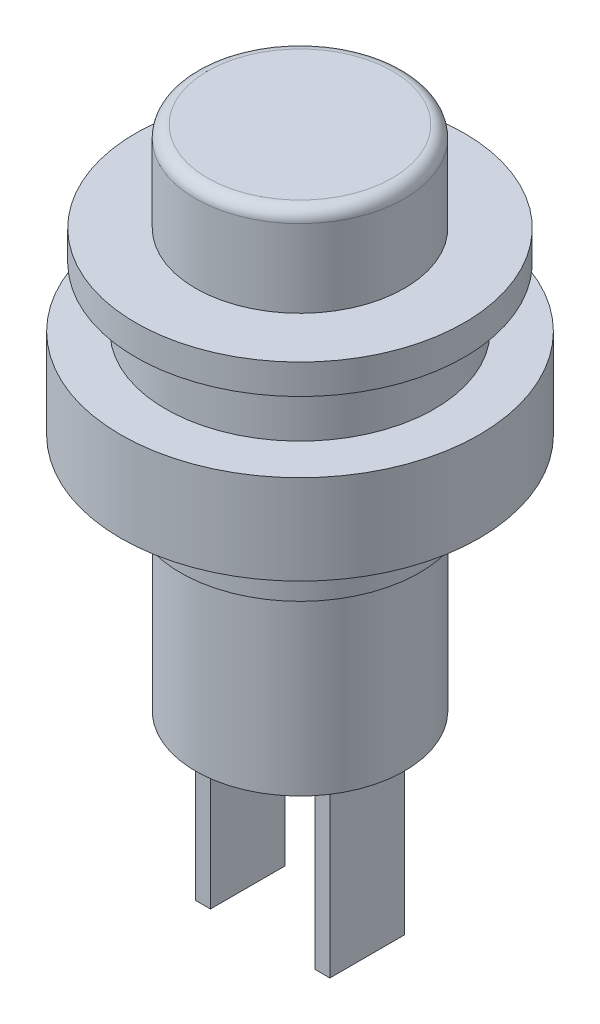
ISO-10303-21;
HEADER;
FILE_DESCRIPTION(('STEP AP214'),'2;1');
FILE_NAME('part.step','',(''),(''),'','','');
FILE_SCHEMA(('AUTOMOTIVE_DESIGN { 1 0 10303 214 1 1 1 1 }'));
ENDSEC;
DATA;
#1=APPLICATION_CONTEXT('core data for automotive mechanical design processes');
#2=APPLICATION_PROTOCOL_DEFINITION('international standard','automotive_design',2000,#1);
#3=PRODUCT_CONTEXT('',#1,'mechanical');
#4=PRODUCT('Part','Part','',(#3));
#5=PRODUCT_RELATED_PRODUCT_CATEGORY('part','',(#4));
#6=PRODUCT_DEFINITION_FORMATION('','',#4);
#7=PRODUCT_DEFINITION_CONTEXT('part definition',#1,'design');
#8=PRODUCT_DEFINITION('design','',#6,#7);
#9=PRODUCT_DEFINITION_SHAPE('','',#8);
#10=(LENGTH_UNIT() NAMED_UNIT(*) SI_UNIT(.MILLI.,.METRE.));
#11=(NAMED_UNIT(*) PLANE_ANGLE_UNIT() SI_UNIT($,.RADIAN.));
#12=(NAMED_UNIT(*) SI_UNIT($,.STERADIAN.) SOLID_ANGLE_UNIT());
#13=UNCERTAINTY_MEASURE_WITH_UNIT(LENGTH_MEASURE(1.E-05),#10,'distance_accuracy_value','');
#14=(GEOMETRIC_REPRESENTATION_CONTEXT(3) GLOBAL_UNCERTAINTY_ASSIGNED_CONTEXT((#13)) GLOBAL_UNIT_ASSIGNED_CONTEXT((#10,
#11,#12)) REPRESENTATION_CONTEXT('',''));
#15=CARTESIAN_POINT('',(0.,0.,0.));
#16=DIRECTION('',(0.,0.,1.));
#17=DIRECTION('',(1.,0.,0.));
#18=AXIS2_PLACEMENT_3D('',#15,#16,#17);
#19=CARTESIAN_POINT('',(0.,3.,0.));
#20=DIRECTION('',(0.,-1.,0.));
#21=DIRECTION('',(0.,0.,-1.));
#22=AXIS2_PLACEMENT_3D('',#19,#20,#21);
#23=CYLINDRICAL_SURFACE('',#22,3.5);
#24=CARTESIAN_POINT('',(0.,2.6,0.));
#25=DIRECTION('',(0.,1.,0.));
#26=DIRECTION('',(0.,0.,1.));
#27=AXIS2_PLACEMENT_3D('',#24,#25,#26);
#28=CIRCLE('',#27,3.5);
#29=CARTESIAN_POINT('',(0.,2.6,3.5));
#30=VERTEX_POINT('',#29);
#31=EDGE_CURVE('E39',#30,#30,#28,.F.);
#32=ORIENTED_EDGE('',*,*,#31,.T.);
#33=EDGE_LOOP('',(#32));
#34=FACE_BOUND('',#33,.T.);
#35=CARTESIAN_POINT('',(0.,0.,0.));
#36=DIRECTION('',(0.,1.,0.));
#37=DIRECTION('',(0.,0.,1.));
#38=AXIS2_PLACEMENT_3D('',#35,#36,#37);
#39=CIRCLE('',#38,3.5);
#40=CARTESIAN_POINT('',(0.,0.,3.5));
#41=VERTEX_POINT('',#40);
#42=EDGE_CURVE('E191',#41,#41,#39,.T.);
#43=ORIENTED_EDGE('',*,*,#42,.T.);
#44=EDGE_LOOP('',(#43));
#45=FACE_BOUND('',#44,.T.);
#46=ADVANCED_FACE('F35',(#34,#45),#23,.T.);
#47=CARTESIAN_POINT('',(0.,3.,0.));
#48=DIRECTION('',(0.,1.,0.));
#49=DIRECTION('',(0.,0.,1.));
#50=AXIS2_PLACEMENT_3D('',#47,#48,#49);
#51=PLANE('',#50);
#52=CARTESIAN_POINT('',(0.,3.,0.));
#53=DIRECTION('',(0.,1.,0.));
#54=DIRECTION('',(0.,0.,1.));
#55=AXIS2_PLACEMENT_3D('',#52,#53,#54);
#56=CIRCLE('',#55,3.1);
#57=CARTESIAN_POINT('',(0.,3.,3.1));
#58=VERTEX_POINT('',#57);
#59=EDGE_CURVE('E195',#58,#58,#56,.T.);
#60=ORIENTED_EDGE('',*,*,#59,.T.);
#61=EDGE_LOOP('',(#60));
#62=FACE_BOUND('',#61,.T.);
#63=ADVANCED_FACE('F207',(#62),#51,.T.);
#64=CARTESIAN_POINT('',(0.,2.6,0.));
#65=DIRECTION('',(0.,1.,0.));
#66=DIRECTION('',(0.,0.,1.));
#67=AXIS2_PLACEMENT_3D('',#64,#65,#66);
#68=TOROIDAL_SURFACE('',#67,3.1,0.4);
#69=ORIENTED_EDGE('',*,*,#31,.F.);
#70=EDGE_LOOP('',(#69));
#71=FACE_BOUND('',#70,.T.);
#72=ORIENTED_EDGE('',*,*,#59,.F.);
#73=EDGE_LOOP('',(#72));
#74=FACE_BOUND('',#73,.T.);
#75=ADVANCED_FACE('F37',(#71,#74),#68,.T.);
#76=CARTESIAN_POINT('',(0.,-1.,0.));
#77=DIRECTION('',(0.,1.,0.));
#78=DIRECTION('',(0.,0.,1.));
#79=AXIS2_PLACEMENT_3D('',#76,#77,#78);
#80=CYLINDRICAL_SURFACE('',#79,5.5);
#81=CARTESIAN_POINT('',(0.,-1.,0.));
#82=DIRECTION('',(0.,-1.,0.));
#83=DIRECTION('',(0.,0.,-1.));
#84=AXIS2_PLACEMENT_3D('',#81,#82,#83);
#85=CIRCLE('',#84,5.5);
#86=CARTESIAN_POINT('',(0.,-1.,-5.5));
#87=VERTEX_POINT('',#86);
#88=EDGE_CURVE('E188',#87,#87,#85,.T.);
#89=ORIENTED_EDGE('',*,*,#88,.F.);
#90=EDGE_LOOP('',(#89));
#91=FACE_BOUND('',#90,.T.);
#92=CARTESIAN_POINT('',(0.,0.,0.));
#93=DIRECTION('',(0.,-1.,0.));
#94=DIRECTION('',(0.,0.,-1.));
#95=AXIS2_PLACEMENT_3D('',#92,#93,#94);
#96=CIRCLE('',#95,5.5);
#97=CARTESIAN_POINT('',(0.,0.,-5.5));
#98=VERTEX_POINT('',#97);
#99=EDGE_CURVE('E185',#98,#98,#96,.T.);
#100=ORIENTED_EDGE('',*,*,#99,.T.);
#101=EDGE_LOOP('',(#100));
#102=FACE_BOUND('',#101,.T.);
#103=ADVANCED_FACE('F206',(#91,#102),#80,.T.);
#104=CARTESIAN_POINT('',(0.,-1.,0.));
#105=DIRECTION('',(0.,-1.,0.));
#106=DIRECTION('',(0.,0.,-1.));
#107=AXIS2_PLACEMENT_3D('',#104,#105,#106);
#108=PLANE('',#107);
#109=CARTESIAN_POINT('',(0.,-1.,0.));
#110=DIRECTION('',(0.,-1.,0.));
#111=DIRECTION('',(0.,0.,-1.));
#112=AXIS2_PLACEMENT_3D('',#109,#110,#111);
#113=CIRCLE('',#112,4.5);
#114=CARTESIAN_POINT('',(0.,-1.,-4.5));
#115=VERTEX_POINT('',#114);
#116=EDGE_CURVE('E176',#115,#115,#113,.T.);
#117=ORIENTED_EDGE('',*,*,#116,.F.);
#118=EDGE_LOOP('',(#117));
#119=FACE_BOUND('',#118,.T.);
#120=ORIENTED_EDGE('',*,*,#88,.T.);
#121=EDGE_LOOP('',(#120));
#122=FACE_BOUND('',#121,.T.);
#123=ADVANCED_FACE('F212',(#119,#122),#108,.T.);
#124=CARTESIAN_POINT('',(0.,0.,0.));
#125=DIRECTION('',(0.,-1.,0.));
#126=DIRECTION('',(0.,0.,-1.));
#127=AXIS2_PLACEMENT_3D('',#124,#125,#126);
#128=PLANE('',#127);
#129=ORIENTED_EDGE('',*,*,#42,.F.);
#130=EDGE_LOOP('',(#129));
#131=FACE_BOUND('',#130,.T.);
#132=ORIENTED_EDGE('',*,*,#99,.F.);
#133=EDGE_LOOP('',(#132));
#134=FACE_BOUND('',#133,.T.);
#135=ADVANCED_FACE('F220',(#131,#134),#128,.F.);
#136=CARTESIAN_POINT('',(0.,-3.,0.));
#137=DIRECTION('',(0.,1.,0.));
#138=DIRECTION('',(0.,0.,1.));
#139=AXIS2_PLACEMENT_3D('',#136,#137,#138);
#140=CYLINDRICAL_SURFACE('',#139,4.5);
#141=CARTESIAN_POINT('',(0.,-3.,0.));
#142=DIRECTION('',(0.,-1.,0.));
#143=DIRECTION('',(0.,0.,-1.));
#144=AXIS2_PLACEMENT_3D('',#141,#142,#143);
#145=CIRCLE('',#144,4.5);
#146=CARTESIAN_POINT('',(0.,-3.,-4.5));
#147=VERTEX_POINT('',#146);
#148=EDGE_CURVE('E180',#147,#147,#145,.T.);
#149=ORIENTED_EDGE('',*,*,#148,.F.);
#150=EDGE_LOOP('',(#149));
#151=FACE_BOUND('',#150,.T.);
#152=ORIENTED_EDGE('',*,*,#116,.T.);
#153=EDGE_LOOP('',(#152));
#154=FACE_BOUND('',#153,.T.);
#155=ADVANCED_FACE('F223',(#151,#154),#140,.T.);
#156=CARTESIAN_POINT('',(0.,-6.,0.));
#157=DIRECTION('',(0.,1.,0.));
#158=DIRECTION('',(0.,0.,1.));
#159=AXIS2_PLACEMENT_3D('',#156,#157,#158);
#160=CYLINDRICAL_SURFACE('',#159,6.);
#161=CARTESIAN_POINT('',(0.,-6.,0.));
#162=DIRECTION('',(0.,-1.,0.));
#163=DIRECTION('',(0.,0.,-1.));
#164=AXIS2_PLACEMENT_3D('',#161,#162,#163);
#165=CIRCLE('',#164,6.);
#166=CARTESIAN_POINT('',(0.,-6.,-6.));
#167=VERTEX_POINT('',#166);
#168=EDGE_CURVE('E177',#167,#167,#165,.T.);
#169=ORIENTED_EDGE('',*,*,#168,.F.);
#170=EDGE_LOOP('',(#169));
#171=FACE_BOUND('',#170,.T.);
#172=CARTESIAN_POINT('',(0.,-3.,0.));
#173=DIRECTION('',(0.,-1.,0.));
#174=DIRECTION('',(0.,0.,-1.));
#175=AXIS2_PLACEMENT_3D('',#172,#173,#174);
#176=CIRCLE('',#175,6.);
#177=CARTESIAN_POINT('',(0.,-3.,-6.));
#178=VERTEX_POINT('',#177);
#179=EDGE_CURVE('E173',#178,#178,#176,.T.);
#180=ORIENTED_EDGE('',*,*,#179,.T.);
#181=EDGE_LOOP('',(#180));
#182=FACE_BOUND('',#181,.T.);
#183=ADVANCED_FACE('F230',(#171,#182),#160,.T.);
#184=CARTESIAN_POINT('',(0.,-6.,0.));
#185=DIRECTION('',(0.,-1.,0.));
#186=DIRECTION('',(0.,0.,-1.));
#187=AXIS2_PLACEMENT_3D('',#184,#185,#186);
#188=PLANE('',#187);
#189=CARTESIAN_POINT('',(0.,-6.,0.));
#190=DIRECTION('',(0.,-1.,0.));
#191=DIRECTION('',(0.,0.,-1.));
#192=AXIS2_PLACEMENT_3D('',#189,#190,#191);
#193=CIRCLE('',#192,4.);
#194=CARTESIAN_POINT('',(0.,-6.,-4.));
#195=VERTEX_POINT('',#194);
#196=EDGE_CURVE('E44',#195,#195,#193,.T.);
#197=ORIENTED_EDGE('',*,*,#196,.F.);
#198=EDGE_LOOP('',(#197));
#199=FACE_BOUND('',#198,.T.);
#200=ORIENTED_EDGE('',*,*,#168,.T.);
#201=EDGE_LOOP('',(#200));
#202=FACE_BOUND('',#201,.T.);
#203=ADVANCED_FACE('F234',(#199,#202),#188,.T.);
#204=CARTESIAN_POINT('',(0.,-3.,0.));
#205=DIRECTION('',(0.,-1.,0.));
#206=DIRECTION('',(0.,0.,-1.));
#207=AXIS2_PLACEMENT_3D('',#204,#205,#206);
#208=PLANE('',#207);
#209=ORIENTED_EDGE('',*,*,#148,.T.);
#210=EDGE_LOOP('',(#209));
#211=FACE_BOUND('',#210,.T.);
#212=ORIENTED_EDGE('',*,*,#179,.F.);
#213=EDGE_LOOP('',(#212));
#214=FACE_BOUND('',#213,.T.);
#215=ADVANCED_FACE('F236',(#211,#214),#208,.F.);
#216=CARTESIAN_POINT('',(0.,-8.,0.));
#217=DIRECTION('',(0.,1.,0.));
#218=DIRECTION('',(0.,0.,1.));
#219=AXIS2_PLACEMENT_3D('',#216,#217,#218);
#220=CYLINDRICAL_SURFACE('',#219,4.);
#221=CARTESIAN_POINT('',(0.,-8.,0.));
#222=DIRECTION('',(0.,-1.,0.));
#223=DIRECTION('',(0.,0.,-1.));
#224=AXIS2_PLACEMENT_3D('',#221,#222,#223);
#225=CIRCLE('',#224,4.);
#226=CARTESIAN_POINT('',(0.,-8.,-4.));
#227=VERTEX_POINT('',#226);
#228=EDGE_CURVE('E169',#227,#227,#225,.T.);
#229=ORIENTED_EDGE('',*,*,#228,.F.);
#230=EDGE_LOOP('',(#229));
#231=FACE_BOUND('',#230,.T.);
#232=ORIENTED_EDGE('',*,*,#196,.T.);
#233=EDGE_LOOP('',(#232));
#234=FACE_BOUND('',#233,.T.);
#235=ADVANCED_FACE('F239',(#231,#234),#220,.T.);
#236=CARTESIAN_POINT('',(0.,-8.,0.));
#237=DIRECTION('',(0.,-1.,0.));
#238=DIRECTION('',(0.,0.,-1.));
#239=AXIS2_PLACEMENT_3D('',#236,#237,#238);
#240=PLANE('',#239);
#241=CARTESIAN_POINT('',(0.,-8.,0.));
#242=DIRECTION('',(0.,-1.,0.));
#243=DIRECTION('',(0.,0.,-1.));
#244=AXIS2_PLACEMENT_3D('',#241,#242,#243);
#245=CIRCLE('',#244,3.5);
#246=CARTESIAN_POINT('',(0.,-8.,-3.5));
#247=VERTEX_POINT('',#246);
#248=EDGE_CURVE('E11',#247,#247,#245,.T.);
#249=ORIENTED_EDGE('',*,*,#248,.F.);
#250=EDGE_LOOP('',(#249));
#251=FACE_BOUND('',#250,.T.);
#252=ORIENTED_EDGE('',*,*,#228,.T.);
#253=EDGE_LOOP('',(#252));
#254=FACE_BOUND('',#253,.T.);
#255=ADVANCED_FACE('F246',(#251,#254),#240,.T.);
#256=CARTESIAN_POINT('',(0.,-14.,0.));
#257=DIRECTION('',(0.,1.,0.));
#258=DIRECTION('',(0.,0.,1.));
#259=AXIS2_PLACEMENT_3D('',#256,#257,#258);
#260=CYLINDRICAL_SURFACE('',#259,3.5);
#261=CARTESIAN_POINT('',(0.,-14.,0.));
#262=DIRECTION('',(0.,-1.,0.));
#263=DIRECTION('',(0.,0.,-1.));
#264=AXIS2_PLACEMENT_3D('',#261,#262,#263);
#265=CIRCLE('',#264,3.5);
#266=CARTESIAN_POINT('',(0.,-14.,-3.5));
#267=VERTEX_POINT('',#266);
#268=EDGE_CURVE('E167',#267,#267,#265,.T.);
#269=ORIENTED_EDGE('',*,*,#268,.F.);
#270=EDGE_LOOP('',(#269));
#271=FACE_BOUND('',#270,.T.);
#272=ORIENTED_EDGE('',*,*,#248,.T.);
#273=EDGE_LOOP('',(#272));
#274=FACE_BOUND('',#273,.T.);
#275=ADVANCED_FACE('F250',(#271,#274),#260,.T.);
#276=CARTESIAN_POINT('',(0.,-14.,0.));
#277=DIRECTION('',(0.,-1.,0.));
#278=DIRECTION('',(0.,0.,-1.));
#279=AXIS2_PLACEMENT_3D('',#276,#277,#278);
#280=PLANE('',#279);
#281=DIRECTION('',(0.,0.,1.));
#282=VECTOR('',#281,1.);
#283=CARTESIAN_POINT('',(1.75,-14.,0.));
#284=LINE('',#283,#282);
#285=CARTESIAN_POINT('',(1.75,-14.,-1.25));
#286=VERTEX_POINT('',#285);
#287=CARTESIAN_POINT('',(1.75,-14.,1.25));
#288=VERTEX_POINT('',#287);
#289=EDGE_CURVE('E107',#286,#288,#284,.T.);
#290=ORIENTED_EDGE('',*,*,#289,.T.);
#291=DIRECTION('',(1.,0.,0.));
#292=VECTOR('',#291,1.);
#293=CARTESIAN_POINT('',(0.,-14.,1.25));
#294=LINE('',#293,#292);
#295=CARTESIAN_POINT('',(2.25,-14.,1.25));
#296=VERTEX_POINT('',#295);
#297=EDGE_CURVE('E123',#288,#296,#294,.T.);
#298=ORIENTED_EDGE('',*,*,#297,.T.);
#299=DIRECTION('',(0.,0.,1.));
#300=VECTOR('',#299,1.);
#301=CARTESIAN_POINT('',(2.25,-14.,0.));
#302=LINE('',#301,#300);
#303=CARTESIAN_POINT('',(2.25,-14.,-1.25));
#304=VERTEX_POINT('',#303);
#305=EDGE_CURVE('E57',#304,#296,#302,.T.);
#306=ORIENTED_EDGE('',*,*,#305,.F.);
#307=DIRECTION('',(1.,0.,0.));
#308=VECTOR('',#307,1.);
#309=CARTESIAN_POINT('',(0.,-14.,-1.25));
#310=LINE('',#309,#308);
#311=EDGE_CURVE('E52',#286,#304,#310,.T.);
#312=ORIENTED_EDGE('',*,*,#311,.F.);
#313=EDGE_LOOP('',(#290,#298,#306,#312));
#314=FACE_BOUND('',#313,.T.);
#315=DIRECTION('',(0.,0.,1.));
#316=VECTOR('',#315,1.);
#317=CARTESIAN_POINT('',(-2.25,-14.,0.));
#318=LINE('',#317,#316);
#319=CARTESIAN_POINT('',(-2.25,-14.,-1.25));
#320=VERTEX_POINT('',#319);
#321=CARTESIAN_POINT('',(-2.25,-14.,1.25));
#322=VERTEX_POINT('',#321);
#323=EDGE_CURVE('E109',#320,#322,#318,.T.);
#324=ORIENTED_EDGE('',*,*,#323,.T.);
#325=DIRECTION('',(-1.,0.,0.));
#326=VECTOR('',#325,1.);
#327=CARTESIAN_POINT('',(0.,-14.,1.25));
#328=LINE('',#327,#326);
#329=CARTESIAN_POINT('',(-1.75,-14.,1.25));
#330=VERTEX_POINT('',#329);
#331=EDGE_CURVE('E142',#330,#322,#328,.T.);
#332=ORIENTED_EDGE('',*,*,#331,.F.);
#333=DIRECTION('',(0.,0.,1.));
#334=VECTOR('',#333,1.);
#335=CARTESIAN_POINT('',(-1.75,-14.,0.));
#336=LINE('',#335,#334);
#337=CARTESIAN_POINT('',(-1.75,-14.,-1.25));
#338=VERTEX_POINT('',#337);
#339=EDGE_CURVE('E155',#338,#330,#336,.T.);
#340=ORIENTED_EDGE('',*,*,#339,.F.);
#341=DIRECTION('',(-1.,0.,0.));
#342=VECTOR('',#341,1.);
#343=CARTESIAN_POINT('',(0.,-14.,-1.25));
#344=LINE('',#343,#342);
#345=EDGE_CURVE('E152',#338,#320,#344,.T.);
#346=ORIENTED_EDGE('',*,*,#345,.T.);
#347=EDGE_LOOP('',(#324,#332,#340,#346));
#348=FACE_BOUND('',#347,.T.);
#349=ORIENTED_EDGE('',*,*,#268,.T.);
#350=EDGE_LOOP('',(#349));
#351=FACE_BOUND('',#350,.T.);
#352=ADVANCED_FACE('F254',(#314,#348,#351),#280,.T.);
#353=CARTESIAN_POINT('',(-2.25,-20.,0.));
#354=DIRECTION('',(-1.,0.,0.));
#355=DIRECTION('',(0.,0.,1.));
#356=AXIS2_PLACEMENT_3D('',#353,#354,#355);
#357=PLANE('',#356);
#358=ORIENTED_EDGE('',*,*,#323,.F.);
#359=DIRECTION('',(0.,1.,0.));
#360=VECTOR('',#359,1.);
#361=CARTESIAN_POINT('',(-2.25,-20.,-1.25));
#362=LINE('',#361,#360);
#363=CARTESIAN_POINT('',(-2.25,-20.,-1.25));
#364=VERTEX_POINT('',#363);
#365=EDGE_CURVE('E165',#364,#320,#362,.T.);
#366=ORIENTED_EDGE('',*,*,#365,.F.);
#367=DIRECTION('',(0.,0.,1.));
#368=VECTOR('',#367,1.);
#369=CARTESIAN_POINT('',(-2.25,-20.,0.));
#370=LINE('',#369,#368);
#371=CARTESIAN_POINT('',(-2.25,-20.,1.25));
#372=VERTEX_POINT('',#371);
#373=EDGE_CURVE('E138',#364,#372,#370,.T.);
#374=ORIENTED_EDGE('',*,*,#373,.T.);
#375=DIRECTION('',(0.,1.,0.));
#376=VECTOR('',#375,1.);
#377=CARTESIAN_POINT('',(-2.25,-20.,1.25));
#378=LINE('',#377,#376);
#379=EDGE_CURVE('E149',#372,#322,#378,.T.);
#380=ORIENTED_EDGE('',*,*,#379,.T.);
#381=EDGE_LOOP('',(#358,#366,#374,#380));
#382=FACE_BOUND('',#381,.T.);
#383=ADVANCED_FACE('F258',(#382),#357,.T.);
#384=CARTESIAN_POINT('',(0.,-20.,-1.25));
#385=DIRECTION('',(0.,0.,-1.));
#386=DIRECTION('',(-1.,0.,0.));
#387=AXIS2_PLACEMENT_3D('',#384,#385,#386);
#388=PLANE('',#387);
#389=ORIENTED_EDGE('',*,*,#345,.F.);
#390=DIRECTION('',(0.,1.,0.));
#391=VECTOR('',#390,1.);
#392=CARTESIAN_POINT('',(-1.75,-20.,-1.25));
#393=LINE('',#392,#391);
#394=CARTESIAN_POINT('',(-1.75,-20.,-1.25));
#395=VERTEX_POINT('',#394);
#396=EDGE_CURVE('E163',#395,#338,#393,.T.);
#397=ORIENTED_EDGE('',*,*,#396,.F.);
#398=DIRECTION('',(-1.,0.,0.));
#399=VECTOR('',#398,1.);
#400=CARTESIAN_POINT('',(0.,-20.,-1.25));
#401=LINE('',#400,#399);
#402=EDGE_CURVE('E141',#395,#364,#401,.T.);
#403=ORIENTED_EDGE('',*,*,#402,.T.);
#404=ORIENTED_EDGE('',*,*,#365,.T.);
#405=EDGE_LOOP('',(#389,#397,#403,#404));
#406=FACE_BOUND('',#405,.T.);
#407=ADVANCED_FACE('F261',(#406),#388,.T.);
#408=CARTESIAN_POINT('',(-1.75,-20.,0.));
#409=DIRECTION('',(-1.,0.,0.));
#410=DIRECTION('',(0.,0.,1.));
#411=AXIS2_PLACEMENT_3D('',#408,#409,#410);
#412=PLANE('',#411);
#413=ORIENTED_EDGE('',*,*,#339,.T.);
#414=DIRECTION('',(0.,1.,0.));
#415=VECTOR('',#414,1.);
#416=CARTESIAN_POINT('',(-1.75,-20.,1.25));
#417=LINE('',#416,#415);
#418=CARTESIAN_POINT('',(-1.75,-20.,1.25));
#419=VERTEX_POINT('',#418);
#420=EDGE_CURVE('E161',#419,#330,#417,.T.);
#421=ORIENTED_EDGE('',*,*,#420,.F.);
#422=DIRECTION('',(0.,0.,1.));
#423=VECTOR('',#422,1.);
#424=CARTESIAN_POINT('',(-1.75,-20.,0.));
#425=LINE('',#424,#423);
#426=EDGE_CURVE('E145',#395,#419,#425,.T.);
#427=ORIENTED_EDGE('',*,*,#426,.F.);
#428=ORIENTED_EDGE('',*,*,#396,.T.);
#429=EDGE_LOOP('',(#413,#421,#427,#428));
#430=FACE_BOUND('',#429,.T.);
#431=ADVANCED_FACE('F265',(#430),#412,.F.);
#432=CARTESIAN_POINT('',(0.,-20.,1.25));
#433=DIRECTION('',(0.,0.,-1.));
#434=DIRECTION('',(-1.,0.,0.));
#435=AXIS2_PLACEMENT_3D('',#432,#433,#434);
#436=PLANE('',#435);
#437=ORIENTED_EDGE('',*,*,#331,.T.);
#438=ORIENTED_EDGE('',*,*,#379,.F.);
#439=DIRECTION('',(-1.,0.,0.));
#440=VECTOR('',#439,1.);
#441=CARTESIAN_POINT('',(0.,-20.,1.25));
#442=LINE('',#441,#440);
#443=EDGE_CURVE('E147',#419,#372,#442,.T.);
#444=ORIENTED_EDGE('',*,*,#443,.F.);
#445=ORIENTED_EDGE('',*,*,#420,.T.);
#446=EDGE_LOOP('',(#437,#438,#444,#445));
#447=FACE_BOUND('',#446,.T.);
#448=ADVANCED_FACE('F269',(#447),#436,.F.);
#449=CARTESIAN_POINT('',(0.,-20.,0.));
#450=DIRECTION('',(0.,-1.,0.));
#451=DIRECTION('',(0.,0.,-1.));
#452=AXIS2_PLACEMENT_3D('',#449,#450,#451);
#453=PLANE('',#452);
#454=ORIENTED_EDGE('',*,*,#373,.F.);
#455=ORIENTED_EDGE('',*,*,#402,.F.);
#456=ORIENTED_EDGE('',*,*,#426,.T.);
#457=ORIENTED_EDGE('',*,*,#443,.T.);
#458=EDGE_LOOP('',(#454,#455,#456,#457));
#459=FACE_BOUND('',#458,.T.);
#460=ADVANCED_FACE('F273',(#459),#453,.T.);
#461=CARTESIAN_POINT('',(1.75,-20.,0.));
#462=DIRECTION('',(-1.,0.,0.));
#463=DIRECTION('',(0.,0.,1.));
#464=AXIS2_PLACEMENT_3D('',#461,#462,#463);
#465=PLANE('',#464);
#466=ORIENTED_EDGE('',*,*,#289,.F.);
#467=DIRECTION('',(0.,1.,0.));
#468=VECTOR('',#467,1.);
#469=CARTESIAN_POINT('',(1.75,-20.,-1.25));
#470=LINE('',#469,#468);
#471=CARTESIAN_POINT('',(1.75,-20.,-1.25));
#472=VERTEX_POINT('',#471);
#473=EDGE_CURVE('E100',#472,#286,#470,.T.);
#474=ORIENTED_EDGE('',*,*,#473,.F.);
#475=DIRECTION('',(0.,0.,1.));
#476=VECTOR('',#475,1.);
#477=CARTESIAN_POINT('',(1.75,-20.,0.));
#478=LINE('',#477,#476);
#479=CARTESIAN_POINT('',(1.75,-20.,1.25));
#480=VERTEX_POINT('',#479);
#481=EDGE_CURVE('E105',#472,#480,#478,.T.);
#482=ORIENTED_EDGE('',*,*,#481,.T.);
#483=DIRECTION('',(0.,1.,0.));
#484=VECTOR('',#483,1.);
#485=CARTESIAN_POINT('',(1.75,-20.,1.25));
#486=LINE('',#485,#484);
#487=EDGE_CURVE('E129',#480,#288,#486,.T.);
#488=ORIENTED_EDGE('',*,*,#487,.T.);
#489=EDGE_LOOP('',(#466,#474,#482,#488));
#490=FACE_BOUND('',#489,.T.);
#491=ADVANCED_FACE('F102',(#490),#465,.T.);
#492=CARTESIAN_POINT('',(0.,-20.,-1.25));
#493=DIRECTION('',(0.,0.,1.));
#494=DIRECTION('',(1.,0.,0.));
#495=AXIS2_PLACEMENT_3D('',#492,#493,#494);
#496=PLANE('',#495);
#497=ORIENTED_EDGE('',*,*,#311,.T.);
#498=DIRECTION('',(0.,1.,0.));
#499=VECTOR('',#498,1.);
#500=CARTESIAN_POINT('',(2.25,-20.,-1.25));
#501=LINE('',#500,#499);
#502=CARTESIAN_POINT('',(2.25,-20.,-1.25));
#503=VERTEX_POINT('',#502);
#504=EDGE_CURVE('E110',#503,#304,#501,.T.);
#505=ORIENTED_EDGE('',*,*,#504,.F.);
#506=DIRECTION('',(1.,0.,0.));
#507=VECTOR('',#506,1.);
#508=CARTESIAN_POINT('',(0.,-20.,-1.25));
#509=LINE('',#508,#507);
#510=EDGE_CURVE('E113',#472,#503,#509,.T.);
#511=ORIENTED_EDGE('',*,*,#510,.F.);
#512=ORIENTED_EDGE('',*,*,#473,.T.);
#513=EDGE_LOOP('',(#497,#505,#511,#512));
#514=FACE_BOUND('',#513,.T.);
#515=ADVANCED_FACE('F114',(#514),#496,.F.);
#516=CARTESIAN_POINT('',(2.25,-20.,0.));
#517=DIRECTION('',(-1.,0.,0.));
#518=DIRECTION('',(0.,0.,1.));
#519=AXIS2_PLACEMENT_3D('',#516,#517,#518);
#520=PLANE('',#519);
#521=ORIENTED_EDGE('',*,*,#305,.T.);
#522=DIRECTION('',(0.,1.,0.));
#523=VECTOR('',#522,1.);
#524=CARTESIAN_POINT('',(2.25,-20.,1.25));
#525=LINE('',#524,#523);
#526=CARTESIAN_POINT('',(2.25,-20.,1.25));
#527=VERTEX_POINT('',#526);
#528=EDGE_CURVE('E134',#527,#296,#525,.T.);
#529=ORIENTED_EDGE('',*,*,#528,.F.);
#530=DIRECTION('',(0.,0.,1.));
#531=VECTOR('',#530,1.);
#532=CARTESIAN_POINT('',(2.25,-20.,0.));
#533=LINE('',#532,#531);
#534=EDGE_CURVE('E118',#503,#527,#533,.T.);
#535=ORIENTED_EDGE('',*,*,#534,.F.);
#536=ORIENTED_EDGE('',*,*,#504,.T.);
#537=EDGE_LOOP('',(#521,#529,#535,#536));
#538=FACE_BOUND('',#537,.T.);
#539=ADVANCED_FACE('F282',(#538),#520,.F.);
#540=CARTESIAN_POINT('',(0.,-20.,1.25));
#541=DIRECTION('',(0.,0.,1.));
#542=DIRECTION('',(1.,0.,0.));
#543=AXIS2_PLACEMENT_3D('',#540,#541,#542);
#544=PLANE('',#543);
#545=ORIENTED_EDGE('',*,*,#297,.F.);
#546=ORIENTED_EDGE('',*,*,#487,.F.);
#547=DIRECTION('',(1.,0.,0.));
#548=VECTOR('',#547,1.);
#549=CARTESIAN_POINT('',(0.,-20.,1.25));
#550=LINE('',#549,#548);
#551=EDGE_CURVE('E122',#480,#527,#550,.T.);
#552=ORIENTED_EDGE('',*,*,#551,.T.);
#553=ORIENTED_EDGE('',*,*,#528,.T.);
#554=EDGE_LOOP('',(#545,#546,#552,#553));
#555=FACE_BOUND('',#554,.T.);
#556=ADVANCED_FACE('F285',(#555),#544,.T.);
#557=CARTESIAN_POINT('',(0.,-20.,0.));
#558=DIRECTION('',(0.,-1.,0.));
#559=DIRECTION('',(0.,0.,-1.));
#560=AXIS2_PLACEMENT_3D('',#557,#558,#559);
#561=PLANE('',#560);
#562=ORIENTED_EDGE('',*,*,#481,.F.);
#563=ORIENTED_EDGE('',*,*,#510,.T.);
#564=ORIENTED_EDGE('',*,*,#534,.T.);
#565=ORIENTED_EDGE('',*,*,#551,.F.);
#566=EDGE_LOOP('',(#562,#563,#564,#565));
#567=FACE_BOUND('',#566,.T.);
#568=ADVANCED_FACE('F120',(#567),#561,.T.);
#569=CLOSED_SHELL('',(#46,#63,#75,#103,#123,#135,#155,#183,#203,#215,#235,#255,#275,#352,#383,
#407,#431,#448,#460,#491,#515,#539,#556,#568));
#570=MANIFOLD_SOLID_BREP('B2',#569);
#571=ADVANCED_BREP_SHAPE_REPRESENTATION('',(#18,#570),#14);
#572=SHAPE_DEFINITION_REPRESENTATION(#9,#571);
ENDSEC;
END-ISO-10303-21;
